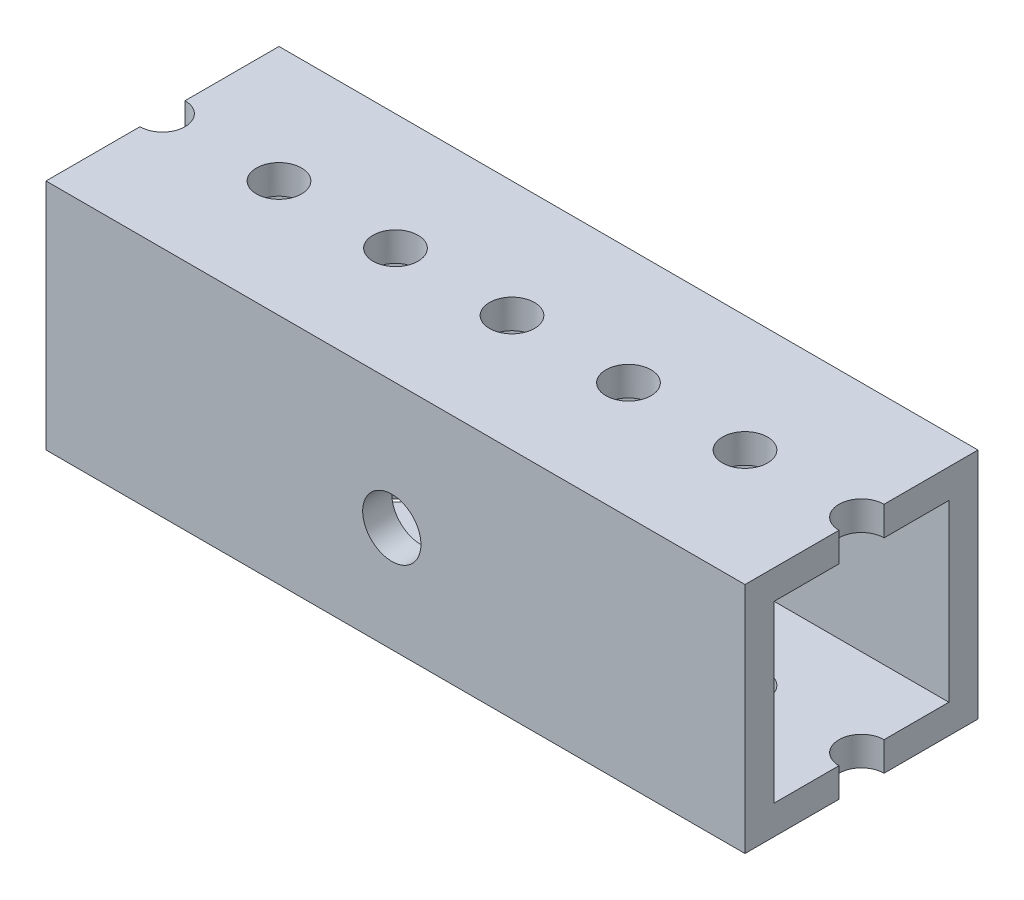
ISO-10303-21;
HEADER;
FILE_DESCRIPTION(('STEP AP214'),'2;1');
FILE_NAME('part.step','',(''),(''),'','','');
FILE_SCHEMA(('AUTOMOTIVE_DESIGN { 1 0 10303 214 1 1 1 1 }'));
ENDSEC;
DATA;
#1=APPLICATION_CONTEXT('core data for automotive mechanical design processes');
#2=APPLICATION_PROTOCOL_DEFINITION('international standard','automotive_design',2000,#1);
#3=PRODUCT_CONTEXT('',#1,'mechanical');
#4=PRODUCT('Part','Part','',(#3));
#5=PRODUCT_RELATED_PRODUCT_CATEGORY('part','',(#4));
#6=PRODUCT_DEFINITION_FORMATION('','',#4);
#7=PRODUCT_DEFINITION_CONTEXT('part definition',#1,'design');
#8=PRODUCT_DEFINITION('design','',#6,#7);
#9=PRODUCT_DEFINITION_SHAPE('','',#8);
#10=(LENGTH_UNIT() NAMED_UNIT(*) SI_UNIT(.MILLI.,.METRE.));
#11=(NAMED_UNIT(*) PLANE_ANGLE_UNIT() SI_UNIT($,.RADIAN.));
#12=(NAMED_UNIT(*) SI_UNIT($,.STERADIAN.) SOLID_ANGLE_UNIT());
#13=UNCERTAINTY_MEASURE_WITH_UNIT(LENGTH_MEASURE(1.E-05),#10,'distance_accuracy_value','');
#14=(GEOMETRIC_REPRESENTATION_CONTEXT(3) GLOBAL_UNCERTAINTY_ASSIGNED_CONTEXT((#13)) GLOBAL_UNIT_ASSIGNED_CONTEXT((#10,
#11,#12)) REPRESENTATION_CONTEXT('',''));
#15=CARTESIAN_POINT('',(0.,0.,0.));
#16=DIRECTION('',(0.,0.,1.));
#17=DIRECTION('',(1.,0.,0.));
#18=AXIS2_PLACEMENT_3D('',#15,#16,#17);
#19=CARTESIAN_POINT('',(38.1,12.7,12.7));
#20=DIRECTION('',(0.,-1.,0.));
#21=DIRECTION('',(0.,0.,-1.));
#22=AXIS2_PLACEMENT_3D('',#19,#20,#21);
#23=PLANE('',#22);
#24=CARTESIAN_POINT('',(12.7,12.7,0.));
#25=DIRECTION('',(0.,1.,0.));
#26=DIRECTION('',(0.,0.,1.));
#27=AXIS2_PLACEMENT_3D('',#24,#25,#26);
#28=CIRCLE('',#27,2.45745);
#29=CARTESIAN_POINT('',(12.7,12.7,2.45745));
#30=VERTEX_POINT('',#29);
#31=EDGE_CURVE('E431',#30,#30,#28,.T.);
#32=ORIENTED_EDGE('',*,*,#31,.F.);
#33=EDGE_LOOP('',(#32));
#34=FACE_BOUND('',#33,.T.);
#35=CARTESIAN_POINT('',(-25.4,12.7,0.));
#36=DIRECTION('',(0.,1.,0.));
#37=DIRECTION('',(0.,0.,1.));
#38=AXIS2_PLACEMENT_3D('',#35,#36,#37);
#39=CIRCLE('',#38,2.45745);
#40=CARTESIAN_POINT('',(-25.4,12.7,2.45745));
#41=VERTEX_POINT('',#40);
#42=EDGE_CURVE('E459',#41,#41,#39,.T.);
#43=ORIENTED_EDGE('',*,*,#42,.F.);
#44=EDGE_LOOP('',(#43));
#45=FACE_BOUND('',#44,.T.);
#46=CARTESIAN_POINT('',(-12.7,12.7,0.));
#47=DIRECTION('',(0.,1.,0.));
#48=DIRECTION('',(0.,0.,1.));
#49=AXIS2_PLACEMENT_3D('',#46,#47,#48);
#50=CIRCLE('',#49,2.45745);
#51=CARTESIAN_POINT('',(-12.7,12.7,2.45745));
#52=VERTEX_POINT('',#51);
#53=EDGE_CURVE('E468',#52,#52,#50,.T.);
#54=ORIENTED_EDGE('',*,*,#53,.F.);
#55=EDGE_LOOP('',(#54));
#56=FACE_BOUND('',#55,.T.);
#57=CARTESIAN_POINT('',(0.,12.7,0.));
#58=DIRECTION('',(0.,1.,0.));
#59=DIRECTION('',(0.,0.,1.));
#60=AXIS2_PLACEMENT_3D('',#57,#58,#59);
#61=CIRCLE('',#60,2.45745);
#62=CARTESIAN_POINT('',(0.,12.7,2.45745));
#63=VERTEX_POINT('',#62);
#64=EDGE_CURVE('E479',#63,#63,#61,.T.);
#65=ORIENTED_EDGE('',*,*,#64,.F.);
#66=EDGE_LOOP('',(#65));
#67=FACE_BOUND('',#66,.T.);
#68=CARTESIAN_POINT('',(25.4,12.7,0.));
#69=DIRECTION('',(0.,1.,0.));
#70=DIRECTION('',(0.,0.,1.));
#71=AXIS2_PLACEMENT_3D('',#68,#69,#70);
#72=CIRCLE('',#71,2.45745);
#73=CARTESIAN_POINT('',(25.4,12.7,2.45745));
#74=VERTEX_POINT('',#73);
#75=EDGE_CURVE('E663',#74,#74,#72,.T.);
#76=ORIENTED_EDGE('',*,*,#75,.F.);
#77=EDGE_LOOP('',(#76));
#78=FACE_BOUND('',#77,.T.);
#79=CARTESIAN_POINT('',(38.1,12.7,0.));
#80=DIRECTION('',(0.,1.,0.));
#81=DIRECTION('',(0.,0.,1.));
#82=AXIS2_PLACEMENT_3D('',#79,#80,#81);
#83=CIRCLE('',#82,2.45745);
#84=CARTESIAN_POINT('',(38.1,12.7,-2.45745));
#85=VERTEX_POINT('',#84);
#86=CARTESIAN_POINT('',(38.1,12.7,2.45745));
#87=VERTEX_POINT('',#86);
#88=EDGE_CURVE('E649',#85,#87,#83,.T.);
#89=ORIENTED_EDGE('',*,*,#88,.F.);
#90=DIRECTION('',(0.,0.,1.));
#91=VECTOR('',#90,1.);
#92=CARTESIAN_POINT('',(38.1,12.7,12.7));
#93=LINE('',#92,#91);
#94=CARTESIAN_POINT('',(38.1,12.7,-12.7));
#95=VERTEX_POINT('',#94);
#96=EDGE_CURVE('E368',#95,#85,#93,.T.);
#97=ORIENTED_EDGE('',*,*,#96,.F.);
#98=DIRECTION('',(-1.,0.,0.));
#99=VECTOR('',#98,1.);
#100=CARTESIAN_POINT('',(38.1,12.7,-12.7));
#101=LINE('',#100,#99);
#102=CARTESIAN_POINT('',(-38.1,12.7,-12.7));
#103=VERTEX_POINT('',#102);
#104=EDGE_CURVE('E398',#95,#103,#101,.T.);
#105=ORIENTED_EDGE('',*,*,#104,.T.);
#106=DIRECTION('',(0.,0.,1.));
#107=VECTOR('',#106,1.);
#108=CARTESIAN_POINT('',(-38.1,12.7,12.7));
#109=LINE('',#108,#107);
#110=CARTESIAN_POINT('',(-38.1,12.7,-2.45745));
#111=VERTEX_POINT('',#110);
#112=EDGE_CURVE('E376',#103,#111,#109,.T.);
#113=ORIENTED_EDGE('',*,*,#112,.T.);
#114=CARTESIAN_POINT('',(-38.1,12.7,0.));
#115=DIRECTION('',(0.,1.,0.));
#116=DIRECTION('',(0.,0.,1.));
#117=AXIS2_PLACEMENT_3D('',#114,#115,#116);
#118=CIRCLE('',#117,2.45745);
#119=CARTESIAN_POINT('',(-38.1,12.7,2.45745));
#120=VERTEX_POINT('',#119);
#121=EDGE_CURVE('E428',#120,#111,#118,.T.);
#122=ORIENTED_EDGE('',*,*,#121,.F.);
#123=CARTESIAN_POINT('',(-38.1,12.7,12.7));
#124=VERTEX_POINT('',#123);
#125=EDGE_CURVE('E372',#120,#124,#109,.T.);
#126=ORIENTED_EDGE('',*,*,#125,.T.);
#127=DIRECTION('',(-1.,0.,0.));
#128=VECTOR('',#127,1.);
#129=CARTESIAN_POINT('',(38.1,12.7,12.7));
#130=LINE('',#129,#128);
#131=CARTESIAN_POINT('',(38.1,12.7,12.7));
#132=VERTEX_POINT('',#131);
#133=EDGE_CURVE('E392',#132,#124,#130,.T.);
#134=ORIENTED_EDGE('',*,*,#133,.F.);
#135=EDGE_CURVE('E542',#87,#132,#93,.T.);
#136=ORIENTED_EDGE('',*,*,#135,.F.);
#137=EDGE_LOOP('',(#89,#97,#105,#113,#122,#126,#134,#136));
#138=FACE_BOUND('',#137,.T.);
#139=ADVANCED_FACE('F224',(#34,#45,#56,#67,#78,#138),#23,.F.);
#140=CARTESIAN_POINT('',(38.1,0.,0.));
#141=DIRECTION('',(-1.,0.,0.));
#142=DIRECTION('',(0.,0.,1.));
#143=AXIS2_PLACEMENT_3D('',#140,#141,#142);
#144=PLANE('',#143);
#145=DIRECTION('',(0.,0.,-1.));
#146=VECTOR('',#145,1.);
#147=CARTESIAN_POINT('',(38.1,-12.7,12.7));
#148=LINE('',#147,#146);
#149=CARTESIAN_POINT('',(38.1,-12.7,12.7));
#150=VERTEX_POINT('',#149);
#151=CARTESIAN_POINT('',(38.1,-12.7,2.45744999999999));
#152=VERTEX_POINT('',#151);
#153=EDGE_CURVE('E359',#150,#152,#148,.T.);
#154=ORIENTED_EDGE('',*,*,#153,.T.);
#155=DIRECTION('',(0.,1.,0.));
#156=VECTOR('',#155,1.);
#157=CARTESIAN_POINT('',(38.1,12.7,2.45745));
#158=LINE('',#157,#156);
#159=CARTESIAN_POINT('',(38.1,-9.525,2.45745));
#160=VERTEX_POINT('',#159);
#161=EDGE_CURVE('E12',#152,#160,#158,.T.);
#162=ORIENTED_EDGE('',*,*,#161,.T.);
#163=DIRECTION('',(0.,0.,-1.));
#164=VECTOR('',#163,1.);
#165=CARTESIAN_POINT('',(38.1,-9.525,9.525));
#166=LINE('',#165,#164);
#167=CARTESIAN_POINT('',(38.1,-9.525,9.525));
#168=VERTEX_POINT('',#167);
#169=EDGE_CURVE('E508',#168,#160,#166,.T.);
#170=ORIENTED_EDGE('',*,*,#169,.F.);
#171=DIRECTION('',(0.,-1.,0.));
#172=VECTOR('',#171,1.);
#173=CARTESIAN_POINT('',(38.1,-9.525,9.525));
#174=LINE('',#173,#172);
#175=CARTESIAN_POINT('',(38.1,9.525,9.525));
#176=VERTEX_POINT('',#175);
#177=EDGE_CURVE('E502',#176,#168,#174,.T.);
#178=ORIENTED_EDGE('',*,*,#177,.F.);
#179=DIRECTION('',(0.,0.,1.));
#180=VECTOR('',#179,1.);
#181=CARTESIAN_POINT('',(38.1,9.525,9.525));
#182=LINE('',#181,#180);
#183=CARTESIAN_POINT('',(38.1,9.525,2.45745));
#184=VERTEX_POINT('',#183);
#185=EDGE_CURVE('E496',#184,#176,#182,.T.);
#186=ORIENTED_EDGE('',*,*,#185,.F.);
#187=EDGE_CURVE('E226',#184,#87,#158,.T.);
#188=ORIENTED_EDGE('',*,*,#187,.T.);
#189=ORIENTED_EDGE('',*,*,#135,.T.);
#190=DIRECTION('',(0.,-1.,0.));
#191=VECTOR('',#190,1.);
#192=CARTESIAN_POINT('',(38.1,-12.7,12.7));
#193=LINE('',#192,#191);
#194=EDGE_CURVE('E363',#132,#150,#193,.T.);
#195=ORIENTED_EDGE('',*,*,#194,.T.);
#196=EDGE_LOOP('',(#154,#162,#170,#178,#186,#188,#189,#195));
#197=FACE_BOUND('',#196,.T.);
#198=ADVANCED_FACE('F554',(#197),#144,.F.);
#199=CARTESIAN_POINT('',(-38.1,0.,0.));
#200=DIRECTION('',(-1.,0.,0.));
#201=DIRECTION('',(0.,0.,1.));
#202=AXIS2_PLACEMENT_3D('',#199,#200,#201);
#203=PLANE('',#202);
#204=DIRECTION('',(0.,1.,0.));
#205=VECTOR('',#204,1.);
#206=CARTESIAN_POINT('',(-38.1,12.7,2.45745));
#207=LINE('',#206,#205);
#208=CARTESIAN_POINT('',(-38.1,-12.7,2.45744999999999));
#209=VERTEX_POINT('',#208);
#210=CARTESIAN_POINT('',(-38.1,-9.525,2.45745));
#211=VERTEX_POINT('',#210);
#212=EDGE_CURVE('E451',#209,#211,#207,.T.);
#213=ORIENTED_EDGE('',*,*,#212,.F.);
#214=DIRECTION('',(0.,0.,-1.));
#215=VECTOR('',#214,1.);
#216=CARTESIAN_POINT('',(-38.1,-12.7,12.7));
#217=LINE('',#216,#215);
#218=CARTESIAN_POINT('',(-38.1,-12.7,12.7));
#219=VERTEX_POINT('',#218);
#220=EDGE_CURVE('E383',#219,#209,#217,.T.);
#221=ORIENTED_EDGE('',*,*,#220,.F.);
#222=DIRECTION('',(0.,-1.,0.));
#223=VECTOR('',#222,1.);
#224=CARTESIAN_POINT('',(-38.1,-12.7,12.7));
#225=LINE('',#224,#223);
#226=EDGE_CURVE('E379',#124,#219,#225,.T.);
#227=ORIENTED_EDGE('',*,*,#226,.F.);
#228=ORIENTED_EDGE('',*,*,#125,.F.);
#229=CARTESIAN_POINT('',(-38.1,9.525,2.45745));
#230=VERTEX_POINT('',#229);
#231=EDGE_CURVE('E457',#230,#120,#207,.T.);
#232=ORIENTED_EDGE('',*,*,#231,.F.);
#233=DIRECTION('',(0.,0.,1.));
#234=VECTOR('',#233,1.);
#235=CARTESIAN_POINT('',(-38.1,9.525,9.525));
#236=LINE('',#235,#234);
#237=CARTESIAN_POINT('',(-38.1,9.525,9.525));
#238=VERTEX_POINT('',#237);
#239=EDGE_CURVE('E516',#230,#238,#236,.T.);
#240=ORIENTED_EDGE('',*,*,#239,.T.);
#241=DIRECTION('',(0.,-1.,0.));
#242=VECTOR('',#241,1.);
#243=CARTESIAN_POINT('',(-38.1,-9.525,9.525));
#244=LINE('',#243,#242);
#245=CARTESIAN_POINT('',(-38.1,-9.525,9.525));
#246=VERTEX_POINT('',#245);
#247=EDGE_CURVE('E525',#238,#246,#244,.T.);
#248=ORIENTED_EDGE('',*,*,#247,.T.);
#249=DIRECTION('',(0.,0.,-1.));
#250=VECTOR('',#249,1.);
#251=CARTESIAN_POINT('',(-38.1,-9.525,9.525));
#252=LINE('',#251,#250);
#253=EDGE_CURVE('E498',#246,#211,#252,.T.);
#254=ORIENTED_EDGE('',*,*,#253,.T.);
#255=EDGE_LOOP('',(#213,#221,#227,#228,#232,#240,#248,#254));
#256=FACE_BOUND('',#255,.T.);
#257=ADVANCED_FACE('F743',(#256),#203,.T.);
#258=ORIENTED_EDGE('',*,*,#96,.T.);
#259=DIRECTION('',(0.,1.,0.));
#260=VECTOR('',#259,1.);
#261=CARTESIAN_POINT('',(38.1,12.7,-2.45745));
#262=LINE('',#261,#260);
#263=CARTESIAN_POINT('',(38.1,9.525,-2.45744999999999));
#264=VERTEX_POINT('',#263);
#265=EDGE_CURVE('E353',#85,#264,#262,.F.);
#266=ORIENTED_EDGE('',*,*,#265,.T.);
#267=CARTESIAN_POINT('',(38.1,9.525,-9.525));
#268=VERTEX_POINT('',#267);
#269=EDGE_CURVE('E504',#268,#264,#182,.T.);
#270=ORIENTED_EDGE('',*,*,#269,.F.);
#271=DIRECTION('',(0.,1.,0.));
#272=VECTOR('',#271,1.);
#273=CARTESIAN_POINT('',(38.1,-9.525,-9.525));
#274=LINE('',#273,#272);
#275=CARTESIAN_POINT('',(38.1,-9.525,-9.525));
#276=VERTEX_POINT('',#275);
#277=EDGE_CURVE('E497',#276,#268,#274,.T.);
#278=ORIENTED_EDGE('',*,*,#277,.F.);
#279=CARTESIAN_POINT('',(38.1,-9.525,-2.45745));
#280=VERTEX_POINT('',#279);
#281=EDGE_CURVE('E351',#280,#276,#166,.T.);
#282=ORIENTED_EDGE('',*,*,#281,.F.);
#283=CARTESIAN_POINT('',(38.1,-12.7,-2.45744999999999));
#284=VERTEX_POINT('',#283);
#285=EDGE_CURVE('E333',#280,#284,#262,.F.);
#286=ORIENTED_EDGE('',*,*,#285,.T.);
#287=CARTESIAN_POINT('',(38.1,-12.7,-12.7));
#288=VERTEX_POINT('',#287);
#289=EDGE_CURVE('E349',#284,#288,#148,.T.);
#290=ORIENTED_EDGE('',*,*,#289,.T.);
#291=DIRECTION('',(0.,1.,0.));
#292=VECTOR('',#291,1.);
#293=CARTESIAN_POINT('',(38.1,-12.7,-12.7));
#294=LINE('',#293,#292);
#295=EDGE_CURVE('E389',#288,#95,#294,.T.);
#296=ORIENTED_EDGE('',*,*,#295,.T.);
#297=EDGE_LOOP('',(#258,#266,#270,#278,#282,#286,#290,#296));
#298=FACE_BOUND('',#297,.T.);
#299=ADVANCED_FACE('F350',(#298),#144,.F.);
#300=DIRECTION('',(0.,1.,0.));
#301=VECTOR('',#300,1.);
#302=CARTESIAN_POINT('',(-38.1,12.7,-2.45745));
#303=LINE('',#302,#301);
#304=CARTESIAN_POINT('',(-38.1,9.525,-2.45745));
#305=VERTEX_POINT('',#304);
#306=EDGE_CURVE('E455',#111,#305,#303,.F.);
#307=ORIENTED_EDGE('',*,*,#306,.F.);
#308=ORIENTED_EDGE('',*,*,#112,.F.);
#309=DIRECTION('',(0.,1.,0.));
#310=VECTOR('',#309,1.);
#311=CARTESIAN_POINT('',(-38.1,-12.7,-12.7));
#312=LINE('',#311,#310);
#313=CARTESIAN_POINT('',(-38.1,-12.7,-12.7));
#314=VERTEX_POINT('',#313);
#315=EDGE_CURVE('E367',#314,#103,#312,.T.);
#316=ORIENTED_EDGE('',*,*,#315,.F.);
#317=CARTESIAN_POINT('',(-38.1,-12.7,-2.45744999999999));
#318=VERTEX_POINT('',#317);
#319=EDGE_CURVE('E382',#318,#314,#217,.T.);
#320=ORIENTED_EDGE('',*,*,#319,.F.);
#321=CARTESIAN_POINT('',(-38.1,-9.525,-2.45745));
#322=VERTEX_POINT('',#321);
#323=EDGE_CURVE('E450',#322,#318,#303,.F.);
#324=ORIENTED_EDGE('',*,*,#323,.F.);
#325=CARTESIAN_POINT('',(-38.1,-9.525,-9.525));
#326=VERTEX_POINT('',#325);
#327=EDGE_CURVE('E528',#322,#326,#252,.T.);
#328=ORIENTED_EDGE('',*,*,#327,.T.);
#329=DIRECTION('',(0.,1.,0.));
#330=VECTOR('',#329,1.);
#331=CARTESIAN_POINT('',(-38.1,-9.525,-9.525));
#332=LINE('',#331,#330);
#333=CARTESIAN_POINT('',(-38.1,9.525,-9.525));
#334=VERTEX_POINT('',#333);
#335=EDGE_CURVE('E494',#326,#334,#332,.T.);
#336=ORIENTED_EDGE('',*,*,#335,.T.);
#337=EDGE_CURVE('E520',#334,#305,#236,.T.);
#338=ORIENTED_EDGE('',*,*,#337,.T.);
#339=EDGE_LOOP('',(#307,#308,#316,#320,#324,#328,#336,#338));
#340=FACE_BOUND('',#339,.T.);
#341=ADVANCED_FACE('F625',(#340),#203,.T.);
#342=CARTESIAN_POINT('',(38.1,-12.7,-12.7));
#343=DIRECTION('',(0.,0.,1.));
#344=DIRECTION('',(1.,0.,0.));
#345=AXIS2_PLACEMENT_3D('',#342,#343,#344);
#346=PLANE('',#345);
#347=ORIENTED_EDGE('',*,*,#315,.T.);
#348=ORIENTED_EDGE('',*,*,#104,.F.);
#349=ORIENTED_EDGE('',*,*,#295,.F.);
#350=DIRECTION('',(-1.,0.,0.));
#351=VECTOR('',#350,1.);
#352=CARTESIAN_POINT('',(38.1,-12.7,-12.7));
#353=LINE('',#352,#351);
#354=EDGE_CURVE('E360',#288,#314,#353,.T.);
#355=ORIENTED_EDGE('',*,*,#354,.T.);
#356=EDGE_LOOP('',(#347,#348,#349,#355));
#357=FACE_BOUND('',#356,.T.);
#358=ADVANCED_FACE('F223',(#357),#346,.F.);
#359=CARTESIAN_POINT('',(38.1,-12.7,12.7));
#360=DIRECTION('',(0.,0.,-1.));
#361=DIRECTION('',(-1.,0.,0.));
#362=AXIS2_PLACEMENT_3D('',#359,#360,#361);
#363=PLANE('',#362);
#364=CARTESIAN_POINT('',(-0.402530277765781,-1.19506999999969,12.7));
#365=DIRECTION('',(0.,0.,1.));
#366=DIRECTION('',(1.,0.,0.));
#367=AXIS2_PLACEMENT_3D('',#364,#365,#366);
#368=CIRCLE('',#367,3.175);
#369=CARTESIAN_POINT('',(2.77246972223422,-1.19506999999969,12.7));
#370=VERTEX_POINT('',#369);
#371=EDGE_CURVE('E655',#370,#370,#368,.T.);
#372=ORIENTED_EDGE('',*,*,#371,.F.);
#373=EDGE_LOOP('',(#372));
#374=FACE_BOUND('',#373,.T.);
#375=ORIENTED_EDGE('',*,*,#226,.T.);
#376=DIRECTION('',(-1.,0.,0.));
#377=VECTOR('',#376,1.);
#378=CARTESIAN_POINT('',(38.1,-12.7,12.7));
#379=LINE('',#378,#377);
#380=EDGE_CURVE('E394',#150,#219,#379,.T.);
#381=ORIENTED_EDGE('',*,*,#380,.F.);
#382=ORIENTED_EDGE('',*,*,#194,.F.);
#383=ORIENTED_EDGE('',*,*,#133,.T.);
#384=EDGE_LOOP('',(#375,#381,#382,#383));
#385=FACE_BOUND('',#384,.T.);
#386=ADVANCED_FACE('F562',(#374,#385),#363,.F.);
#387=CARTESIAN_POINT('',(38.1,-12.7,12.7));
#388=DIRECTION('',(0.,1.,0.));
#389=DIRECTION('',(0.,0.,1.));
#390=AXIS2_PLACEMENT_3D('',#387,#388,#389);
#391=PLANE('',#390);
#392=CARTESIAN_POINT('',(25.4,-12.7,0.));
#393=DIRECTION('',(0.,1.,0.));
#394=DIRECTION('',(0.,0.,1.));
#395=AXIS2_PLACEMENT_3D('',#392,#393,#394);
#396=CIRCLE('',#395,2.45744999999999);
#397=CARTESIAN_POINT('',(25.4,-12.7,2.45744999999999));
#398=VERTEX_POINT('',#397);
#399=EDGE_CURVE('E668',#398,#398,#396,.T.);
#400=ORIENTED_EDGE('',*,*,#399,.T.);
#401=EDGE_LOOP('',(#400));
#402=FACE_BOUND('',#401,.T.);
#403=CARTESIAN_POINT('',(12.7,-12.7,0.));
#404=DIRECTION('',(0.,1.,0.));
#405=DIRECTION('',(0.,0.,1.));
#406=AXIS2_PLACEMENT_3D('',#403,#404,#405);
#407=CIRCLE('',#406,2.45744999999999);
#408=CARTESIAN_POINT('',(12.7,-12.7,2.45744999999999));
#409=VERTEX_POINT('',#408);
#410=EDGE_CURVE('E423',#409,#409,#407,.T.);
#411=ORIENTED_EDGE('',*,*,#410,.T.);
#412=EDGE_LOOP('',(#411));
#413=FACE_BOUND('',#412,.T.);
#414=CARTESIAN_POINT('',(-25.4,-12.7,0.));
#415=DIRECTION('',(0.,1.,0.));
#416=DIRECTION('',(0.,0.,1.));
#417=AXIS2_PLACEMENT_3D('',#414,#415,#416);
#418=CIRCLE('',#417,2.45744999999999);
#419=CARTESIAN_POINT('',(-25.4,-12.7,2.45744999999999));
#420=VERTEX_POINT('',#419);
#421=EDGE_CURVE('E413',#420,#420,#418,.T.);
#422=ORIENTED_EDGE('',*,*,#421,.T.);
#423=EDGE_LOOP('',(#422));
#424=FACE_BOUND('',#423,.T.);
#425=CARTESIAN_POINT('',(-12.7,-12.7,0.));
#426=DIRECTION('',(0.,1.,0.));
#427=DIRECTION('',(0.,0.,1.));
#428=AXIS2_PLACEMENT_3D('',#425,#426,#427);
#429=CIRCLE('',#428,2.45744999999999);
#430=CARTESIAN_POINT('',(-12.7,-12.7,2.45744999999999));
#431=VERTEX_POINT('',#430);
#432=EDGE_CURVE('E410',#431,#431,#429,.T.);
#433=ORIENTED_EDGE('',*,*,#432,.T.);
#434=EDGE_LOOP('',(#433));
#435=FACE_BOUND('',#434,.T.);
#436=CARTESIAN_POINT('',(0.,-12.7,0.));
#437=DIRECTION('',(0.,1.,0.));
#438=DIRECTION('',(0.,0.,1.));
#439=AXIS2_PLACEMENT_3D('',#436,#437,#438);
#440=CIRCLE('',#439,2.45744999999999);
#441=CARTESIAN_POINT('',(0.,-12.7,2.45744999999999));
#442=VERTEX_POINT('',#441);
#443=EDGE_CURVE('E483',#442,#442,#440,.T.);
#444=ORIENTED_EDGE('',*,*,#443,.T.);
#445=EDGE_LOOP('',(#444));
#446=FACE_BOUND('',#445,.T.);
#447=ORIENTED_EDGE('',*,*,#289,.F.);
#448=CARTESIAN_POINT('',(38.1,-12.7,0.));
#449=DIRECTION('',(0.,1.,0.));
#450=DIRECTION('',(0.,0.,1.));
#451=AXIS2_PLACEMENT_3D('',#448,#449,#450);
#452=CIRCLE('',#451,2.45744999999999);
#453=EDGE_CURVE('E335',#284,#152,#452,.T.);
#454=ORIENTED_EDGE('',*,*,#453,.T.);
#455=ORIENTED_EDGE('',*,*,#153,.F.);
#456=ORIENTED_EDGE('',*,*,#380,.T.);
#457=ORIENTED_EDGE('',*,*,#220,.T.);
#458=CARTESIAN_POINT('',(-38.1,-12.7,0.));
#459=DIRECTION('',(0.,1.,0.));
#460=DIRECTION('',(0.,0.,1.));
#461=AXIS2_PLACEMENT_3D('',#458,#459,#460);
#462=CIRCLE('',#461,2.45744999999999);
#463=EDGE_CURVE('E441',#209,#318,#462,.T.);
#464=ORIENTED_EDGE('',*,*,#463,.T.);
#465=ORIENTED_EDGE('',*,*,#319,.T.);
#466=ORIENTED_EDGE('',*,*,#354,.F.);
#467=EDGE_LOOP('',(#447,#454,#455,#456,#457,#464,#465,#466));
#468=FACE_BOUND('',#467,.T.);
#469=ADVANCED_FACE('F352',(#402,#413,#424,#435,#446,#468),#391,.F.);
#470=CARTESIAN_POINT('',(38.1,-9.525,-9.525));
#471=DIRECTION('',(0.,0.,1.));
#472=DIRECTION('',(1.,0.,0.));
#473=AXIS2_PLACEMENT_3D('',#470,#471,#472);
#474=PLANE('',#473);
#475=ORIENTED_EDGE('',*,*,#335,.F.);
#476=DIRECTION('',(-1.,0.,0.));
#477=VECTOR('',#476,1.);
#478=CARTESIAN_POINT('',(38.1,-9.525,-9.525));
#479=LINE('',#478,#477);
#480=EDGE_CURVE('E511',#276,#326,#479,.T.);
#481=ORIENTED_EDGE('',*,*,#480,.F.);
#482=ORIENTED_EDGE('',*,*,#277,.T.);
#483=DIRECTION('',(-1.,0.,0.));
#484=VECTOR('',#483,1.);
#485=CARTESIAN_POINT('',(38.1,9.525,-9.525));
#486=LINE('',#485,#484);
#487=EDGE_CURVE('E374',#268,#334,#486,.T.);
#488=ORIENTED_EDGE('',*,*,#487,.T.);
#489=EDGE_LOOP('',(#475,#481,#482,#488));
#490=FACE_BOUND('',#489,.T.);
#491=ADVANCED_FACE('F630',(#490),#474,.T.);
#492=CARTESIAN_POINT('',(38.1,9.525,9.525));
#493=DIRECTION('',(0.,-1.,0.));
#494=DIRECTION('',(0.,0.,-1.));
#495=AXIS2_PLACEMENT_3D('',#492,#493,#494);
#496=PLANE('',#495);
#497=CARTESIAN_POINT('',(38.1,9.525,0.));
#498=DIRECTION('',(0.,-1.,0.));
#499=DIRECTION('',(0.,0.,-1.));
#500=AXIS2_PLACEMENT_3D('',#497,#498,#499);
#501=CIRCLE('',#500,2.45745);
#502=EDGE_CURVE('E239',#184,#264,#501,.T.);
#503=ORIENTED_EDGE('',*,*,#502,.F.);
#504=ORIENTED_EDGE('',*,*,#185,.T.);
#505=DIRECTION('',(-1.,0.,0.));
#506=VECTOR('',#505,1.);
#507=CARTESIAN_POINT('',(38.1,9.525,9.525));
#508=LINE('',#507,#506);
#509=EDGE_CURVE('E536',#176,#238,#508,.T.);
#510=ORIENTED_EDGE('',*,*,#509,.T.);
#511=ORIENTED_EDGE('',*,*,#239,.F.);
#512=CARTESIAN_POINT('',(-38.1,9.525,0.));
#513=DIRECTION('',(0.,-1.,0.));
#514=DIRECTION('',(0.,0.,-1.));
#515=AXIS2_PLACEMENT_3D('',#512,#513,#514);
#516=CIRCLE('',#515,2.45745);
#517=EDGE_CURVE('E454',#305,#230,#516,.T.);
#518=ORIENTED_EDGE('',*,*,#517,.F.);
#519=ORIENTED_EDGE('',*,*,#337,.F.);
#520=ORIENTED_EDGE('',*,*,#487,.F.);
#521=ORIENTED_EDGE('',*,*,#269,.T.);
#522=EDGE_LOOP('',(#503,#504,#510,#511,#518,#519,#520,#521));
#523=FACE_BOUND('',#522,.T.);
#524=CARTESIAN_POINT('',(25.4,9.525,0.));
#525=DIRECTION('',(0.,-1.,0.));
#526=DIRECTION('',(0.,0.,-1.));
#527=AXIS2_PLACEMENT_3D('',#524,#525,#526);
#528=CIRCLE('',#527,2.45744999999999);
#529=CARTESIAN_POINT('',(25.4,9.525,-2.45744999999999));
#530=VERTEX_POINT('',#529);
#531=EDGE_CURVE('E437',#530,#530,#528,.T.);
#532=ORIENTED_EDGE('',*,*,#531,.F.);
#533=EDGE_LOOP('',(#532));
#534=FACE_BOUND('',#533,.T.);
#535=CARTESIAN_POINT('',(12.7,9.525,0.));
#536=DIRECTION('',(0.,-1.,0.));
#537=DIRECTION('',(0.,0.,-1.));
#538=AXIS2_PLACEMENT_3D('',#535,#536,#537);
#539=CIRCLE('',#538,2.45744999999999);
#540=CARTESIAN_POINT('',(12.7,9.525,-2.45744999999999));
#541=VERTEX_POINT('',#540);
#542=EDGE_CURVE('E419',#541,#541,#539,.T.);
#543=ORIENTED_EDGE('',*,*,#542,.F.);
#544=EDGE_LOOP('',(#543));
#545=FACE_BOUND('',#544,.T.);
#546=CARTESIAN_POINT('',(-25.4,9.525,0.));
#547=DIRECTION('',(0.,-1.,0.));
#548=DIRECTION('',(0.,0.,-1.));
#549=AXIS2_PLACEMENT_3D('',#546,#547,#548);
#550=CIRCLE('',#549,2.45744999999999);
#551=CARTESIAN_POINT('',(-25.4,9.525,-2.45744999999999));
#552=VERTEX_POINT('',#551);
#553=EDGE_CURVE('E408',#552,#552,#550,.T.);
#554=ORIENTED_EDGE('',*,*,#553,.F.);
#555=EDGE_LOOP('',(#554));
#556=FACE_BOUND('',#555,.T.);
#557=CARTESIAN_POINT('',(-12.7,9.525,0.));
#558=DIRECTION('',(0.,-1.,0.));
#559=DIRECTION('',(0.,0.,-1.));
#560=AXIS2_PLACEMENT_3D('',#557,#558,#559);
#561=CIRCLE('',#560,2.45744999999999);
#562=CARTESIAN_POINT('',(-12.7,9.525,-2.45744999999999));
#563=VERTEX_POINT('',#562);
#564=EDGE_CURVE('E406',#563,#563,#561,.T.);
#565=ORIENTED_EDGE('',*,*,#564,.F.);
#566=EDGE_LOOP('',(#565));
#567=FACE_BOUND('',#566,.T.);
#568=CARTESIAN_POINT('',(0.,9.525,0.));
#569=DIRECTION('',(0.,-1.,0.));
#570=DIRECTION('',(0.,0.,-1.));
#571=AXIS2_PLACEMENT_3D('',#568,#569,#570);
#572=CIRCLE('',#571,2.45745);
#573=CARTESIAN_POINT('',(0.,9.525,-2.45745));
#574=VERTEX_POINT('',#573);
#575=EDGE_CURVE('E490',#574,#574,#572,.T.);
#576=ORIENTED_EDGE('',*,*,#575,.F.);
#577=EDGE_LOOP('',(#576));
#578=FACE_BOUND('',#577,.T.);
#579=ADVANCED_FACE('F618',(#523,#534,#545,#556,#567,#578),#496,.T.);
#580=CARTESIAN_POINT('',(38.1,-9.525,9.525));
#581=DIRECTION('',(0.,0.,-1.));
#582=DIRECTION('',(-1.,0.,0.));
#583=AXIS2_PLACEMENT_3D('',#580,#581,#582);
#584=PLANE('',#583);
#585=CARTESIAN_POINT('',(-0.402530277765781,-1.19506999999969,9.525));
#586=DIRECTION('',(0.,0.,-1.));
#587=DIRECTION('',(-1.,0.,0.));
#588=AXIS2_PLACEMENT_3D('',#585,#586,#587);
#589=CIRCLE('',#588,3.175);
#590=CARTESIAN_POINT('',(2.77246972223422,-1.19506999999969,9.525));
#591=VERTEX_POINT('',#590);
#592=EDGE_CURVE('E658',#591,#591,#589,.F.);
#593=ORIENTED_EDGE('',*,*,#592,.T.);
#594=EDGE_LOOP('',(#593));
#595=FACE_BOUND('',#594,.T.);
#596=ORIENTED_EDGE('',*,*,#247,.F.);
#597=ORIENTED_EDGE('',*,*,#509,.F.);
#598=ORIENTED_EDGE('',*,*,#177,.T.);
#599=DIRECTION('',(-1.,0.,0.));
#600=VECTOR('',#599,1.);
#601=CARTESIAN_POINT('',(38.1,-9.525,9.525));
#602=LINE('',#601,#600);
#603=EDGE_CURVE('E531',#168,#246,#602,.T.);
#604=ORIENTED_EDGE('',*,*,#603,.T.);
#605=EDGE_LOOP('',(#596,#597,#598,#604));
#606=FACE_BOUND('',#605,.T.);
#607=ADVANCED_FACE('F576',(#595,#606),#584,.T.);
#608=CARTESIAN_POINT('',(38.1,-9.525,9.525));
#609=DIRECTION('',(0.,1.,0.));
#610=DIRECTION('',(0.,0.,1.));
#611=AXIS2_PLACEMENT_3D('',#608,#609,#610);
#612=PLANE('',#611);
#613=CARTESIAN_POINT('',(38.1,-9.525,0.));
#614=DIRECTION('',(0.,1.,0.));
#615=DIRECTION('',(0.,0.,1.));
#616=AXIS2_PLACEMENT_3D('',#613,#614,#615);
#617=CIRCLE('',#616,2.45745);
#618=EDGE_CURVE('E568',#280,#160,#617,.T.);
#619=ORIENTED_EDGE('',*,*,#618,.F.);
#620=ORIENTED_EDGE('',*,*,#281,.T.);
#621=ORIENTED_EDGE('',*,*,#480,.T.);
#622=ORIENTED_EDGE('',*,*,#327,.F.);
#623=CARTESIAN_POINT('',(-38.1,-9.525,0.));
#624=DIRECTION('',(0.,1.,0.));
#625=DIRECTION('',(0.,0.,1.));
#626=AXIS2_PLACEMENT_3D('',#623,#624,#625);
#627=CIRCLE('',#626,2.45745);
#628=EDGE_CURVE('E345',#211,#322,#627,.T.);
#629=ORIENTED_EDGE('',*,*,#628,.F.);
#630=ORIENTED_EDGE('',*,*,#253,.F.);
#631=ORIENTED_EDGE('',*,*,#603,.F.);
#632=ORIENTED_EDGE('',*,*,#169,.T.);
#633=EDGE_LOOP('',(#619,#620,#621,#622,#629,#630,#631,#632));
#634=FACE_BOUND('',#633,.T.);
#635=CARTESIAN_POINT('',(25.4,-9.525,0.));
#636=DIRECTION('',(0.,1.,0.));
#637=DIRECTION('',(0.,0.,1.));
#638=AXIS2_PLACEMENT_3D('',#635,#636,#637);
#639=CIRCLE('',#638,2.45744999999999);
#640=CARTESIAN_POINT('',(25.4,-9.525,2.45744999999999));
#641=VERTEX_POINT('',#640);
#642=EDGE_CURVE('E672',#641,#641,#639,.T.);
#643=ORIENTED_EDGE('',*,*,#642,.F.);
#644=EDGE_LOOP('',(#643));
#645=FACE_BOUND('',#644,.T.);
#646=CARTESIAN_POINT('',(12.7,-9.525,0.));
#647=DIRECTION('',(0.,1.,0.));
#648=DIRECTION('',(0.,0.,1.));
#649=AXIS2_PLACEMENT_3D('',#646,#647,#648);
#650=CIRCLE('',#649,2.45744999999999);
#651=CARTESIAN_POINT('',(12.7,-9.525,2.45744999999999));
#652=VERTEX_POINT('',#651);
#653=EDGE_CURVE('E417',#652,#652,#650,.T.);
#654=ORIENTED_EDGE('',*,*,#653,.F.);
#655=EDGE_LOOP('',(#654));
#656=FACE_BOUND('',#655,.T.);
#657=CARTESIAN_POINT('',(-25.4,-9.525,0.));
#658=DIRECTION('',(0.,1.,0.));
#659=DIRECTION('',(0.,0.,1.));
#660=AXIS2_PLACEMENT_3D('',#657,#658,#659);
#661=CIRCLE('',#660,2.45744999999999);
#662=CARTESIAN_POINT('',(-25.4,-9.525,2.45744999999999));
#663=VERTEX_POINT('',#662);
#664=EDGE_CURVE('E412',#663,#663,#661,.T.);
#665=ORIENTED_EDGE('',*,*,#664,.F.);
#666=EDGE_LOOP('',(#665));
#667=FACE_BOUND('',#666,.T.);
#668=CARTESIAN_POINT('',(-12.7,-9.525,0.));
#669=DIRECTION('',(0.,1.,0.));
#670=DIRECTION('',(0.,0.,1.));
#671=AXIS2_PLACEMENT_3D('',#668,#669,#670);
#672=CIRCLE('',#671,2.45744999999999);
#673=CARTESIAN_POINT('',(-12.7,-9.525,2.45744999999999));
#674=VERTEX_POINT('',#673);
#675=EDGE_CURVE('E401',#674,#674,#672,.T.);
#676=ORIENTED_EDGE('',*,*,#675,.F.);
#677=EDGE_LOOP('',(#676));
#678=FACE_BOUND('',#677,.T.);
#679=CARTESIAN_POINT('',(0.,-9.525,0.));
#680=DIRECTION('',(0.,1.,0.));
#681=DIRECTION('',(0.,0.,1.));
#682=AXIS2_PLACEMENT_3D('',#679,#680,#681);
#683=CIRCLE('',#682,2.45745);
#684=CARTESIAN_POINT('',(0.,-9.525,2.45745));
#685=VERTEX_POINT('',#684);
#686=EDGE_CURVE('E491',#685,#685,#683,.T.);
#687=ORIENTED_EDGE('',*,*,#686,.F.);
#688=EDGE_LOOP('',(#687));
#689=FACE_BOUND('',#688,.T.);
#690=ADVANCED_FACE('F566',(#634,#645,#656,#667,#678,#689),#612,.T.);
#691=CARTESIAN_POINT('',(0.,12.7,0.));
#692=DIRECTION('',(0.,1.,0.));
#693=DIRECTION('',(0.,0.,1.));
#694=AXIS2_PLACEMENT_3D('',#691,#692,#693);
#695=CYLINDRICAL_SURFACE('',#694,2.45745);
#696=ORIENTED_EDGE('',*,*,#575,.T.);
#697=EDGE_LOOP('',(#696));
#698=FACE_BOUND('',#697,.T.);
#699=ORIENTED_EDGE('',*,*,#64,.T.);
#700=EDGE_LOOP('',(#699));
#701=FACE_BOUND('',#700,.T.);
#702=ADVANCED_FACE('F695',(#698,#701),#695,.F.);
#703=ORIENTED_EDGE('',*,*,#686,.T.);
#704=EDGE_LOOP('',(#703));
#705=FACE_BOUND('',#704,.T.);
#706=ORIENTED_EDGE('',*,*,#443,.F.);
#707=EDGE_LOOP('',(#706));
#708=FACE_BOUND('',#707,.T.);
#709=ADVANCED_FACE('F700',(#705,#708),#695,.F.);
#710=CARTESIAN_POINT('',(-12.7,12.7,0.));
#711=DIRECTION('',(0.,1.,0.));
#712=DIRECTION('',(0.,0.,1.));
#713=AXIS2_PLACEMENT_3D('',#710,#711,#712);
#714=CYLINDRICAL_SURFACE('',#713,2.45744999999999);
#715=ORIENTED_EDGE('',*,*,#675,.T.);
#716=EDGE_LOOP('',(#715));
#717=FACE_BOUND('',#716,.T.);
#718=ORIENTED_EDGE('',*,*,#432,.F.);
#719=EDGE_LOOP('',(#718));
#720=FACE_BOUND('',#719,.T.);
#721=ADVANCED_FACE('F732',(#717,#720),#714,.F.);
#722=ORIENTED_EDGE('',*,*,#564,.T.);
#723=EDGE_LOOP('',(#722));
#724=FACE_BOUND('',#723,.T.);
#725=ORIENTED_EDGE('',*,*,#53,.T.);
#726=EDGE_LOOP('',(#725));
#727=FACE_BOUND('',#726,.T.);
#728=ADVANCED_FACE('F728',(#724,#727),#714,.F.);
#729=CARTESIAN_POINT('',(-25.4,12.7,0.));
#730=DIRECTION('',(0.,1.,0.));
#731=DIRECTION('',(0.,0.,1.));
#732=AXIS2_PLACEMENT_3D('',#729,#730,#731);
#733=CYLINDRICAL_SURFACE('',#732,2.45744999999999);
#734=ORIENTED_EDGE('',*,*,#553,.T.);
#735=EDGE_LOOP('',(#734));
#736=FACE_BOUND('',#735,.T.);
#737=ORIENTED_EDGE('',*,*,#42,.T.);
#738=EDGE_LOOP('',(#737));
#739=FACE_BOUND('',#738,.T.);
#740=ADVANCED_FACE('F726',(#736,#739),#733,.F.);
#741=ORIENTED_EDGE('',*,*,#664,.T.);
#742=EDGE_LOOP('',(#741));
#743=FACE_BOUND('',#742,.T.);
#744=ORIENTED_EDGE('',*,*,#421,.F.);
#745=EDGE_LOOP('',(#744));
#746=FACE_BOUND('',#745,.T.);
#747=ADVANCED_FACE('F723',(#743,#746),#733,.F.);
#748=CARTESIAN_POINT('',(-38.1,12.7,0.));
#749=DIRECTION('',(0.,1.,0.));
#750=DIRECTION('',(0.,0.,1.));
#751=AXIS2_PLACEMENT_3D('',#748,#749,#750);
#752=CYLINDRICAL_SURFACE('',#751,2.45745);
#753=ORIENTED_EDGE('',*,*,#212,.T.);
#754=ORIENTED_EDGE('',*,*,#628,.T.);
#755=ORIENTED_EDGE('',*,*,#323,.T.);
#756=ORIENTED_EDGE('',*,*,#463,.F.);
#757=EDGE_LOOP('',(#753,#754,#755,#756));
#758=FACE_BOUND('',#757,.T.);
#759=ADVANCED_FACE('F724',(#758),#752,.F.);
#760=ORIENTED_EDGE('',*,*,#231,.T.);
#761=ORIENTED_EDGE('',*,*,#121,.T.);
#762=ORIENTED_EDGE('',*,*,#306,.T.);
#763=ORIENTED_EDGE('',*,*,#517,.T.);
#764=EDGE_LOOP('',(#760,#761,#762,#763));
#765=FACE_BOUND('',#764,.T.);
#766=ADVANCED_FACE('F612',(#765),#752,.F.);
#767=CARTESIAN_POINT('',(12.7,12.7,0.));
#768=DIRECTION('',(0.,1.,0.));
#769=DIRECTION('',(0.,0.,1.));
#770=AXIS2_PLACEMENT_3D('',#767,#768,#769);
#771=CYLINDRICAL_SURFACE('',#770,2.45744999999999);
#772=ORIENTED_EDGE('',*,*,#653,.T.);
#773=EDGE_LOOP('',(#772));
#774=FACE_BOUND('',#773,.T.);
#775=ORIENTED_EDGE('',*,*,#410,.F.);
#776=EDGE_LOOP('',(#775));
#777=FACE_BOUND('',#776,.T.);
#778=ADVANCED_FACE('F719',(#774,#777),#771,.F.);
#779=ORIENTED_EDGE('',*,*,#542,.T.);
#780=EDGE_LOOP('',(#779));
#781=FACE_BOUND('',#780,.T.);
#782=ORIENTED_EDGE('',*,*,#31,.T.);
#783=EDGE_LOOP('',(#782));
#784=FACE_BOUND('',#783,.T.);
#785=ADVANCED_FACE('F713',(#781,#784),#771,.F.);
#786=CARTESIAN_POINT('',(25.4,12.7,0.));
#787=DIRECTION('',(0.,1.,0.));
#788=DIRECTION('',(0.,0.,1.));
#789=AXIS2_PLACEMENT_3D('',#786,#787,#788);
#790=CYLINDRICAL_SURFACE('',#789,2.45744999999999);
#791=ORIENTED_EDGE('',*,*,#642,.T.);
#792=EDGE_LOOP('',(#791));
#793=FACE_BOUND('',#792,.T.);
#794=ORIENTED_EDGE('',*,*,#399,.F.);
#795=EDGE_LOOP('',(#794));
#796=FACE_BOUND('',#795,.T.);
#797=ADVANCED_FACE('F706',(#793,#796),#790,.F.);
#798=ORIENTED_EDGE('',*,*,#531,.T.);
#799=EDGE_LOOP('',(#798));
#800=FACE_BOUND('',#799,.T.);
#801=ORIENTED_EDGE('',*,*,#75,.T.);
#802=EDGE_LOOP('',(#801));
#803=FACE_BOUND('',#802,.T.);
#804=ADVANCED_FACE('F684',(#800,#803),#790,.F.);
#805=CARTESIAN_POINT('',(38.1,12.7,0.));
#806=DIRECTION('',(0.,1.,0.));
#807=DIRECTION('',(0.,0.,1.));
#808=AXIS2_PLACEMENT_3D('',#805,#806,#807);
#809=CYLINDRICAL_SURFACE('',#808,2.45745);
#810=ORIENTED_EDGE('',*,*,#453,.F.);
#811=ORIENTED_EDGE('',*,*,#285,.F.);
#812=ORIENTED_EDGE('',*,*,#618,.T.);
#813=ORIENTED_EDGE('',*,*,#161,.F.);
#814=EDGE_LOOP('',(#810,#811,#812,#813));
#815=FACE_BOUND('',#814,.T.);
#816=ADVANCED_FACE('F331',(#815),#809,.F.);
#817=ORIENTED_EDGE('',*,*,#502,.T.);
#818=ORIENTED_EDGE('',*,*,#265,.F.);
#819=ORIENTED_EDGE('',*,*,#88,.T.);
#820=ORIENTED_EDGE('',*,*,#187,.F.);
#821=EDGE_LOOP('',(#817,#818,#819,#820));
#822=FACE_BOUND('',#821,.T.);
#823=ADVANCED_FACE('F715',(#822),#809,.F.);
#824=CARTESIAN_POINT('',(-0.402530277765781,-1.19506999999969,-12.701));
#825=DIRECTION('',(0.,0.,1.));
#826=DIRECTION('',(1.,0.,0.));
#827=AXIS2_PLACEMENT_3D('',#824,#825,#826);
#828=CYLINDRICAL_SURFACE('',#827,3.175);
#829=CARTESIAN_POINT('',(2.77246972223422,-1.19506999999969,9.525));
#830=CARTESIAN_POINT('',(2.77246972223422,-1.19506999999969,9.55807291666667));
#831=CARTESIAN_POINT('',(2.77246972223422,-1.19506999999969,9.59114583333334));
#832=CARTESIAN_POINT('',(2.77246972223422,-1.19506999999969,9.65729166666667));
#833=CARTESIAN_POINT('',(2.77246972223422,-1.19506999999969,9.69036458333333));
#834=CARTESIAN_POINT('',(2.77246972223422,-1.19506999999969,9.75651041666667));
#835=CARTESIAN_POINT('',(2.77246972223422,-1.19506999999969,9.78958333333333));
#836=CARTESIAN_POINT('',(2.77246972223422,-1.19506999999969,9.85572916666667));
#837=CARTESIAN_POINT('',(2.77246972223422,-1.19506999999969,9.88880208333333));
#838=CARTESIAN_POINT('',(2.77246972223422,-1.19506999999969,9.95494791666667));
#839=CARTESIAN_POINT('',(2.77246972223422,-1.19506999999969,9.98802083333333));
#840=CARTESIAN_POINT('',(2.77246972223422,-1.19506999999969,10.0541666666667));
#841=CARTESIAN_POINT('',(2.77246972223422,-1.19506999999969,10.0872395833333));
#842=CARTESIAN_POINT('',(2.77246972223422,-1.19506999999969,10.1533854166667));
#843=CARTESIAN_POINT('',(2.77246972223422,-1.19506999999969,10.1864583333333));
#844=CARTESIAN_POINT('',(2.77246972223422,-1.19506999999969,10.2526041666667));
#845=CARTESIAN_POINT('',(2.77246972223422,-1.19506999999969,10.2856770833333));
#846=CARTESIAN_POINT('',(2.77246972223422,-1.19506999999969,10.3518229166667));
#847=CARTESIAN_POINT('',(2.77246972223422,-1.19506999999969,10.3848958333333));
#848=CARTESIAN_POINT('',(2.77246972223422,-1.19506999999969,10.4510416666667));
#849=CARTESIAN_POINT('',(2.77246972223422,-1.19506999999969,10.4841145833333));
#850=CARTESIAN_POINT('',(2.77246972223422,-1.19506999999969,10.5502604166667));
#851=CARTESIAN_POINT('',(2.77246972223422,-1.19506999999969,10.5833333333333));
#852=CARTESIAN_POINT('',(2.77246972223422,-1.19506999999969,10.6494791666667));
#853=CARTESIAN_POINT('',(2.77246972223422,-1.19506999999969,10.6825520833333));
#854=CARTESIAN_POINT('',(2.77246972223422,-1.19506999999969,10.7486979166667));
#855=CARTESIAN_POINT('',(2.77246972223422,-1.19506999999969,10.7817708333333));
#856=CARTESIAN_POINT('',(2.77246972223422,-1.19506999999969,10.8479166666667));
#857=CARTESIAN_POINT('',(2.77246972223422,-1.19506999999969,10.8809895833333));
#858=CARTESIAN_POINT('',(2.77246972223422,-1.19506999999969,10.9471354166667));
#859=CARTESIAN_POINT('',(2.77246972223422,-1.19506999999969,10.9802083333333));
#860=CARTESIAN_POINT('',(2.77246972223422,-1.19506999999969,11.0463541666667));
#861=CARTESIAN_POINT('',(2.77246972223422,-1.19506999999969,11.0794270833333));
#862=CARTESIAN_POINT('',(2.77246972223422,-1.19506999999969,11.1455729166667));
#863=CARTESIAN_POINT('',(2.77246972223422,-1.19506999999969,11.1786458333333));
#864=CARTESIAN_POINT('',(2.77246972223422,-1.19506999999969,11.2447916666667));
#865=CARTESIAN_POINT('',(2.77246972223422,-1.19506999999969,11.2778645833333));
#866=CARTESIAN_POINT('',(2.77246972223422,-1.19506999999969,11.3440104166667));
#867=CARTESIAN_POINT('',(2.77246972223422,-1.19506999999969,11.3770833333333));
#868=CARTESIAN_POINT('',(2.77246972223422,-1.19506999999969,11.4432291666667));
#869=CARTESIAN_POINT('',(2.77246972223422,-1.19506999999969,11.4763020833333));
#870=CARTESIAN_POINT('',(2.77246972223422,-1.19506999999969,11.5424479166667));
#871=CARTESIAN_POINT('',(2.77246972223422,-1.19506999999969,11.5755208333333));
#872=CARTESIAN_POINT('',(2.77246972223422,-1.19506999999969,11.6416666666667));
#873=CARTESIAN_POINT('',(2.77246972223422,-1.19506999999969,11.6747395833333));
#874=CARTESIAN_POINT('',(2.77246972223422,-1.19506999999969,11.7408854166667));
#875=CARTESIAN_POINT('',(2.77246972223422,-1.19506999999969,11.7739583333333));
#876=CARTESIAN_POINT('',(2.77246972223422,-1.19506999999969,11.8401041666667));
#877=CARTESIAN_POINT('',(2.77246972223422,-1.19506999999969,11.8731770833333));
#878=CARTESIAN_POINT('',(2.77246972223422,-1.19506999999969,11.9393229166667));
#879=CARTESIAN_POINT('',(2.77246972223422,-1.19506999999969,11.9723958333333));
#880=CARTESIAN_POINT('',(2.77246972223422,-1.19506999999969,12.0385416666667));
#881=CARTESIAN_POINT('',(2.77246972223422,-1.19506999999969,12.0716145833333));
#882=CARTESIAN_POINT('',(2.77246972223422,-1.19506999999969,12.1377604166667));
#883=CARTESIAN_POINT('',(2.77246972223422,-1.19506999999969,12.1708333333333));
#884=CARTESIAN_POINT('',(2.77246972223422,-1.19506999999969,12.2369791666667));
#885=CARTESIAN_POINT('',(2.77246972223422,-1.19506999999969,12.2700520833333));
#886=CARTESIAN_POINT('',(2.77246972223422,-1.19506999999969,12.3361979166667));
#887=CARTESIAN_POINT('',(2.77246972223422,-1.19506999999969,12.3692708333333));
#888=CARTESIAN_POINT('',(2.77246972223422,-1.19506999999969,12.4354166666667));
#889=CARTESIAN_POINT('',(2.77246972223422,-1.19506999999969,12.4684895833333));
#890=CARTESIAN_POINT('',(2.77246972223422,-1.19506999999969,12.5346354166667));
#891=CARTESIAN_POINT('',(2.77246972223422,-1.19506999999969,12.5677083333333));
#892=CARTESIAN_POINT('',(2.77246972223422,-1.19506999999969,12.6338541666667));
#893=CARTESIAN_POINT('',(2.77246972223422,-1.19506999999969,12.6669270833333));
#894=CARTESIAN_POINT('',(2.77246972223422,-1.19506999999969,12.7));
#895=B_SPLINE_CURVE_WITH_KNOTS('',3,(#829,#830,#831,#832,#833,#834,#835,#836,#837,#838,#839,
#840,#841,#842,#843,#844,#845,#846,#847,#848,#849,#850,#851,#852,#853,#854,#855,#856,#857,#858,
#859,#860,#861,#862,#863,#864,#865,#866,#867,#868,#869,#870,#871,#872,#873,#874,#875,#876,#877,
#878,#879,#880,#881,#882,#883,#884,#885,#886,#887,#888,#889,#890,#891,#892,#893,#894),
.UNSPECIFIED.,.F.,.F.,(4,2,2,2,2,2,2,2,2,2,2,2,2,2,2,2,2,2,2,2,2,2,2,2,2,2,2,2,2,2,2,2,4),(0.,
0.0992187500000012,0.198437499999999,0.29765625,0.396874999999998,0.496093749999999,0.5953125,
0.694531249999998,0.793749999999999,0.892968750000001,0.992187499999998,1.09140625,1.190625,
1.28984375,1.3890625,1.48828125,1.5875,1.68671875,1.7859375,1.88515625,1.984375,2.08359375,
2.1828125,2.28203125,2.38125,2.48046875,2.5796875,2.67890625,2.778125,2.87734375,2.9765625,
3.07578125,3.175),.UNSPECIFIED.);
#896=EDGE_CURVE('BSEAM758',#591,#370,#895,.T.);
#897=ORIENTED_EDGE('',*,*,#592,.F.);
#898=ORIENTED_EDGE('',*,*,#371,.T.);
#899=ORIENTED_EDGE('',*,*,#896,.T.);
#900=ORIENTED_EDGE('',*,*,#896,.F.);
#901=EDGE_LOOP('',(#897,#899,#898,#900));
#902=FACE_BOUND('',#901,.T.);
#903=ADVANCED_FACE('F758',(#902),#828,.F.);
#904=CLOSED_SHELL('',(#139,#198,#257,#299,#341,#358,#386,#469,#491,#579,#607,#690,#702,#709,
#721,#728,#740,#747,#759,#766,#778,#785,#797,#804,#816,#823,#903));
#905=MANIFOLD_SOLID_BREP('B2',#904);
#906=ADVANCED_BREP_SHAPE_REPRESENTATION('',(#18,#905),#14);
#907=SHAPE_DEFINITION_REPRESENTATION(#9,#906);
ENDSEC;
END-ISO-10303-21;
